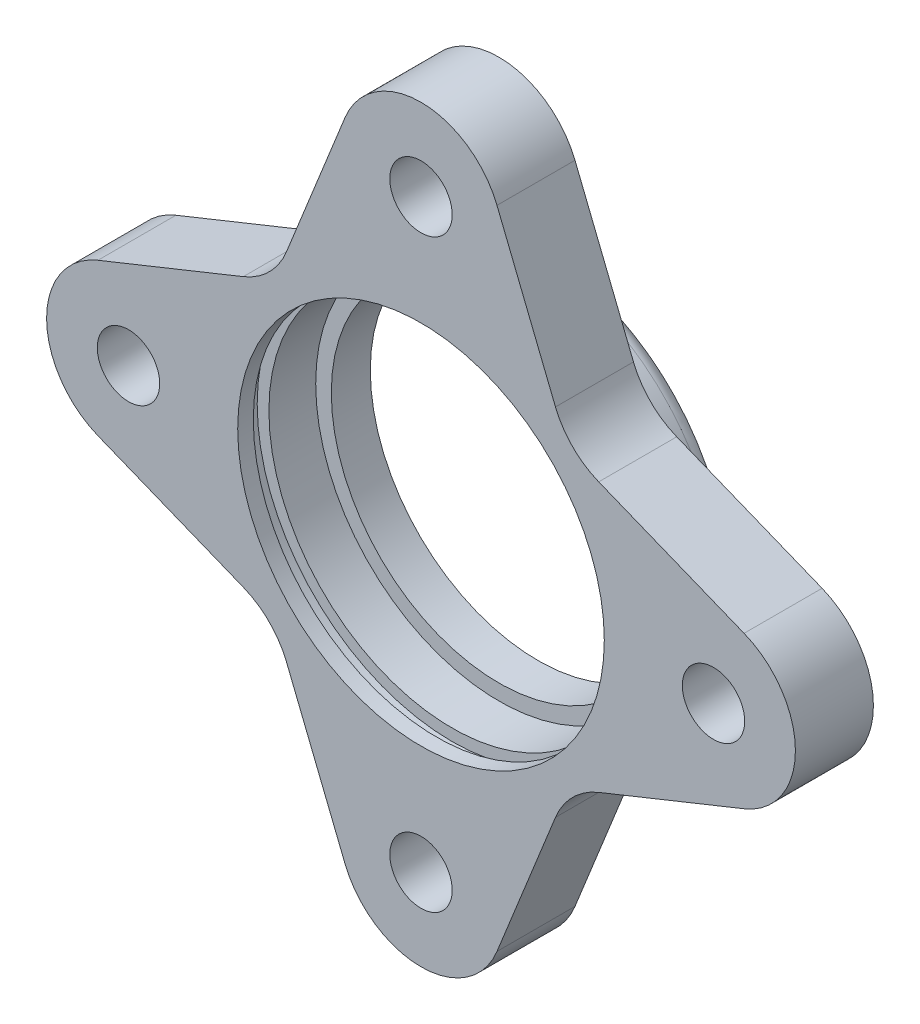
ISO-10303-21;
HEADER;
FILE_DESCRIPTION(('STEP AP214'),'2;1');
FILE_NAME('part.step','',(''),(''),'','','');
FILE_SCHEMA(('AUTOMOTIVE_DESIGN { 1 0 10303 214 1 1 1 1 }'));
ENDSEC;
DATA;
#1=APPLICATION_CONTEXT('core data for automotive mechanical design processes');
#2=APPLICATION_PROTOCOL_DEFINITION('international standard','automotive_design',2000,#1);
#3=PRODUCT_CONTEXT('',#1,'mechanical');
#4=PRODUCT('Part','Part','',(#3));
#5=PRODUCT_RELATED_PRODUCT_CATEGORY('part','',(#4));
#6=PRODUCT_DEFINITION_FORMATION('','',#4);
#7=PRODUCT_DEFINITION_CONTEXT('part definition',#1,'design');
#8=PRODUCT_DEFINITION('design','',#6,#7);
#9=PRODUCT_DEFINITION_SHAPE('','',#8);
#10=(LENGTH_UNIT() NAMED_UNIT(*) SI_UNIT(.MILLI.,.METRE.));
#11=(NAMED_UNIT(*) PLANE_ANGLE_UNIT() SI_UNIT($,.RADIAN.));
#12=(NAMED_UNIT(*) SI_UNIT($,.STERADIAN.) SOLID_ANGLE_UNIT());
#13=UNCERTAINTY_MEASURE_WITH_UNIT(LENGTH_MEASURE(1.E-05),#10,'distance_accuracy_value','');
#14=(GEOMETRIC_REPRESENTATION_CONTEXT(3) GLOBAL_UNCERTAINTY_ASSIGNED_CONTEXT((#13)) GLOBAL_UNIT_ASSIGNED_CONTEXT((#10,
#11,#12)) REPRESENTATION_CONTEXT('',''));
#15=CARTESIAN_POINT('',(0.,0.,0.));
#16=DIRECTION('',(0.,0.,1.));
#17=DIRECTION('',(1.,0.,0.));
#18=AXIS2_PLACEMENT_3D('',#15,#16,#17);
#19=CARTESIAN_POINT('',(0.,0.,10.));
#20=DIRECTION('',(0.,0.,1.));
#21=DIRECTION('',(1.,0.,0.));
#22=AXIS2_PLACEMENT_3D('',#19,#20,#21);
#23=PLANE('',#22);
#24=CARTESIAN_POINT('',(0.,-37.5,10.));
#25=DIRECTION('',(0.,0.,1.));
#26=DIRECTION('',(1.,0.,0.));
#27=AXIS2_PLACEMENT_3D('',#24,#25,#26);
#28=CIRCLE('',#27,4.);
#29=CARTESIAN_POINT('',(4.,-37.5,10.));
#30=VERTEX_POINT('',#29);
#31=EDGE_CURVE('E298',#30,#30,#28,.T.);
#32=ORIENTED_EDGE('',*,*,#31,.F.);
#33=EDGE_LOOP('',(#32));
#34=FACE_BOUND('',#33,.T.);
#35=CARTESIAN_POINT('',(-37.5,0.,10.));
#36=DIRECTION('',(0.,0.,1.));
#37=DIRECTION('',(1.,0.,0.));
#38=AXIS2_PLACEMENT_3D('',#35,#36,#37);
#39=CIRCLE('',#38,4.00000000000001);
#40=CARTESIAN_POINT('',(-33.5,0.,10.));
#41=VERTEX_POINT('',#40);
#42=EDGE_CURVE('E301',#41,#41,#39,.T.);
#43=ORIENTED_EDGE('',*,*,#42,.F.);
#44=EDGE_LOOP('',(#43));
#45=FACE_BOUND('',#44,.T.);
#46=CARTESIAN_POINT('',(0.,37.5,10.));
#47=DIRECTION('',(0.,0.,1.));
#48=DIRECTION('',(1.,0.,0.));
#49=AXIS2_PLACEMENT_3D('',#46,#47,#48);
#50=CIRCLE('',#49,4.);
#51=CARTESIAN_POINT('',(4.,37.5,10.));
#52=VERTEX_POINT('',#51);
#53=EDGE_CURVE('E305',#52,#52,#50,.T.);
#54=ORIENTED_EDGE('',*,*,#53,.F.);
#55=EDGE_LOOP('',(#54));
#56=FACE_BOUND('',#55,.T.);
#57=CARTESIAN_POINT('',(37.5,0.,10.));
#58=DIRECTION('',(0.,0.,1.));
#59=DIRECTION('',(1.,0.,0.));
#60=AXIS2_PLACEMENT_3D('',#57,#58,#59);
#61=CIRCLE('',#60,4.00000000000001);
#62=CARTESIAN_POINT('',(41.5,0.,10.));
#63=VERTEX_POINT('',#62);
#64=EDGE_CURVE('E308',#63,#63,#61,.T.);
#65=ORIENTED_EDGE('',*,*,#64,.F.);
#66=EDGE_LOOP('',(#65));
#67=FACE_BOUND('',#66,.T.);
#68=CARTESIAN_POINT('',(0.,0.,10.));
#69=DIRECTION('',(0.,0.,1.));
#70=DIRECTION('',(1.,0.,0.));
#71=AXIS2_PLACEMENT_3D('',#68,#69,#70);
#72=CIRCLE('',#71,23.5);
#73=CARTESIAN_POINT('',(23.5,0.,10.));
#74=VERTEX_POINT('',#73);
#75=EDGE_CURVE('E311',#74,#74,#72,.T.);
#76=ORIENTED_EDGE('',*,*,#75,.F.);
#77=EDGE_LOOP('',(#76));
#78=FACE_BOUND('',#77,.T.);
#79=CARTESIAN_POINT('',(-37.5,-1.30930550206618E-13,10.));
#80=DIRECTION('',(0.,0.,-1.));
#81=DIRECTION('',(0.,-1.,0.));
#82=AXIS2_PLACEMENT_3D('',#79,#80,#81);
#83=CIRCLE('',#82,10.5);
#84=CARTESIAN_POINT('',(-41.4194101311591,-9.74105868085021,10.));
#85=VERTEX_POINT('',#84);
#86=CARTESIAN_POINT('',(-41.4194101311592,9.74105868085004,10.));
#87=VERTEX_POINT('',#86);
#88=EDGE_CURVE('E155',#85,#87,#83,.T.);
#89=ORIENTED_EDGE('',*,*,#88,.F.);
#90=DIRECTION('',(0.927719874366686,-0.37327715534849,0.));
#91=VECTOR('',#90,1.);
#92=CARTESIAN_POINT('',(-9.14450393259891,-22.7271825182448,10.));
#93=LINE('',#92,#91);
#94=CARTESIAN_POINT('',(-22.7837327410107,-17.2393055508286,10.));
#95=VERTEX_POINT('',#94);
#96=EDGE_CURVE('E159',#85,#95,#93,.T.);
#97=ORIENTED_EDGE('',*,*,#96,.T.);
#98=CARTESIAN_POINT('',(-26.5165042944956,-26.5165042944955,10.));
#99=DIRECTION('',(0.,0.,-1.));
#100=DIRECTION('',(1.,0.,0.));
#101=AXIS2_PLACEMENT_3D('',#98,#99,#100);
#102=CIRCLE('',#101,10.);
#103=CARTESIAN_POINT('',(-17.2393055508287,-22.7837327410106,10.));
#104=VERTEX_POINT('',#103);
#105=EDGE_CURVE('E179',#95,#104,#102,.T.);
#106=ORIENTED_EDGE('',*,*,#105,.T.);
#107=DIRECTION('',(-0.373277155348493,0.927719874366685,0.));
#108=VECTOR('',#107,1.);
#109=CARTESIAN_POINT('',(-22.7271825182448,-9.14450393259902,10.));
#110=LINE('',#109,#108);
#111=CARTESIAN_POINT('',(-9.74105868085018,-41.4194101311592,10.));
#112=VERTEX_POINT('',#111);
#113=EDGE_CURVE('E175',#112,#104,#110,.T.);
#114=ORIENTED_EDGE('',*,*,#113,.F.);
#115=CARTESIAN_POINT('',(3.92791650619853E-13,-37.5,10.));
#116=DIRECTION('',(0.,0.,-1.));
#117=DIRECTION('',(0.,1.,0.));
#118=AXIS2_PLACEMENT_3D('',#115,#116,#117);
#119=CIRCLE('',#118,10.5);
#120=CARTESIAN_POINT('',(9.74105868085064,-41.419410131159,10.));
#121=VERTEX_POINT('',#120);
#122=EDGE_CURVE('E203',#121,#112,#119,.T.);
#123=ORIENTED_EDGE('',*,*,#122,.F.);
#124=DIRECTION('',(0.37327715534848,0.92771987436669,0.));
#125=VECTOR('',#124,1.);
#126=CARTESIAN_POINT('',(22.7271825182449,-9.14450393259867,10.));
#127=LINE('',#126,#125);
#128=CARTESIAN_POINT('',(17.2393055508289,-22.7837327410105,10.));
#129=VERTEX_POINT('',#128);
#130=EDGE_CURVE('E205',#121,#129,#127,.T.);
#131=ORIENTED_EDGE('',*,*,#130,.T.);
#132=CARTESIAN_POINT('',(26.5165042944958,-26.5165042944953,10.));
#133=DIRECTION('',(0.,0.,-1.));
#134=DIRECTION('',(0.,1.,0.));
#135=AXIS2_PLACEMENT_3D('',#132,#133,#134);
#136=CIRCLE('',#135,10.);
#137=CARTESIAN_POINT('',(22.7837327410107,-17.2393055508285,10.));
#138=VERTEX_POINT('',#137);
#139=EDGE_CURVE('E209',#129,#138,#136,.T.);
#140=ORIENTED_EDGE('',*,*,#139,.T.);
#141=DIRECTION('',(-0.927719874366681,-0.373277155348502,0.));
#142=VECTOR('',#141,1.);
#143=CARTESIAN_POINT('',(9.14450393259926,-22.7271825182447,10.));
#144=LINE('',#143,#142);
#145=CARTESIAN_POINT('',(41.4194101311593,-9.74105868084975,10.));
#146=VERTEX_POINT('',#145);
#147=EDGE_CURVE('E212',#146,#138,#144,.T.);
#148=ORIENTED_EDGE('',*,*,#147,.F.);
#149=CARTESIAN_POINT('',(37.5,0.,10.));
#150=DIRECTION('',(0.,0.,-1.));
#151=DIRECTION('',(-1.,0.,0.));
#152=AXIS2_PLACEMENT_3D('',#149,#150,#151);
#153=CIRCLE('',#152,10.5);
#154=CARTESIAN_POINT('',(41.4194101311591,9.74105868085021,10.));
#155=VERTEX_POINT('',#154);
#156=EDGE_CURVE('E255',#155,#146,#153,.T.);
#157=ORIENTED_EDGE('',*,*,#156,.F.);
#158=DIRECTION('',(-0.927719874366686,0.37327715534849,0.));
#159=VECTOR('',#158,1.);
#160=CARTESIAN_POINT('',(9.14450393259891,22.7271825182448,10.));
#161=LINE('',#160,#159);
#162=CARTESIAN_POINT('',(22.7837327410107,17.2393055508286,10.));
#163=VERTEX_POINT('',#162);
#164=EDGE_CURVE('E257',#155,#163,#161,.T.);
#165=ORIENTED_EDGE('',*,*,#164,.T.);
#166=CARTESIAN_POINT('',(26.5165042944956,26.5165042944955,10.));
#167=DIRECTION('',(0.,0.,-1.));
#168=DIRECTION('',(-1.,0.,0.));
#169=AXIS2_PLACEMENT_3D('',#166,#167,#168);
#170=CIRCLE('',#169,10.);
#171=CARTESIAN_POINT('',(17.2393055508287,22.7837327410106,10.));
#172=VERTEX_POINT('',#171);
#173=EDGE_CURVE('E261',#163,#172,#170,.T.);
#174=ORIENTED_EDGE('',*,*,#173,.T.);
#175=DIRECTION('',(0.373277155348493,-0.927719874366685,0.));
#176=VECTOR('',#175,1.);
#177=CARTESIAN_POINT('',(22.7271825182448,9.14450393259902,10.));
#178=LINE('',#177,#176);
#179=CARTESIAN_POINT('',(9.74105868085018,41.4194101311592,10.));
#180=VERTEX_POINT('',#179);
#181=EDGE_CURVE('E264',#180,#172,#178,.T.);
#182=ORIENTED_EDGE('',*,*,#181,.F.);
#183=CARTESIAN_POINT('',(0.,37.5,10.));
#184=DIRECTION('',(0.,0.,-1.));
#185=DIRECTION('',(-1.,0.,0.));
#186=AXIS2_PLACEMENT_3D('',#183,#184,#185);
#187=CIRCLE('',#186,10.5);
#188=CARTESIAN_POINT('',(-9.74105868085035,41.4194101311591,10.));
#189=VERTEX_POINT('',#188);
#190=EDGE_CURVE('E62',#189,#180,#187,.T.);
#191=ORIENTED_EDGE('',*,*,#190,.F.);
#192=DIRECTION('',(-0.373277155348486,-0.927719874366687,0.));
#193=VECTOR('',#192,1.);
#194=CARTESIAN_POINT('',(-22.7271825182448,9.14450393259883,10.));
#195=LINE('',#194,#193);
#196=CARTESIAN_POINT('',(-17.2393055508287,22.7837327410106,10.));
#197=VERTEX_POINT('',#196);
#198=EDGE_CURVE('E232',#189,#197,#195,.T.);
#199=ORIENTED_EDGE('',*,*,#198,.T.);
#200=CARTESIAN_POINT('',(-26.5165042944956,26.5165042944955,10.));
#201=DIRECTION('',(0.,0.,-1.));
#202=DIRECTION('',(0.,-1.,0.));
#203=AXIS2_PLACEMENT_3D('',#200,#201,#202);
#204=CIRCLE('',#203,10.);
#205=CARTESIAN_POINT('',(-22.7837327410106,17.2393055508287,10.));
#206=VERTEX_POINT('',#205);
#207=EDGE_CURVE('E235',#197,#206,#204,.T.);
#208=ORIENTED_EDGE('',*,*,#207,.T.);
#209=DIRECTION('',(0.927719874366684,0.373277155348496,0.));
#210=VECTOR('',#209,1.);
#211=CARTESIAN_POINT('',(-9.1445039325991,22.7271825182448,10.));
#212=LINE('',#211,#210);
#213=EDGE_CURVE('E161',#87,#206,#212,.T.);
#214=ORIENTED_EDGE('',*,*,#213,.F.);
#215=EDGE_LOOP('',(#89,#97,#106,#114,#123,#131,#140,#148,#157,#165,#174,#182,#191,#199,#208,#214));
#216=FACE_BOUND('',#215,.T.);
#217=ADVANCED_FACE('F38',(#34,#45,#56,#67,#78,#216),#23,.T.);
#218=CARTESIAN_POINT('',(0.,0.,0.));
#219=DIRECTION('',(0.,0.,1.));
#220=DIRECTION('',(1.,0.,0.));
#221=AXIS2_PLACEMENT_3D('',#218,#219,#220);
#222=PLANE('',#221);
#223=CARTESIAN_POINT('',(0.,0.,0.));
#224=DIRECTION('',(0.,0.,1.));
#225=DIRECTION('',(1.,0.,0.));
#226=AXIS2_PLACEMENT_3D('',#223,#224,#225);
#227=CIRCLE('',#226,26.5);
#228=CARTESIAN_POINT('',(26.5,0.,0.));
#229=VERTEX_POINT('',#228);
#230=EDGE_CURVE('E11',#229,#229,#227,.T.);
#231=ORIENTED_EDGE('',*,*,#230,.T.);
#232=EDGE_LOOP('',(#231));
#233=FACE_BOUND('',#232,.T.);
#234=CARTESIAN_POINT('',(0.,-37.5,0.));
#235=DIRECTION('',(0.,0.,1.));
#236=DIRECTION('',(1.,0.,0.));
#237=AXIS2_PLACEMENT_3D('',#234,#235,#236);
#238=CIRCLE('',#237,4.);
#239=CARTESIAN_POINT('',(4.,-37.5,0.));
#240=VERTEX_POINT('',#239);
#241=EDGE_CURVE('E295',#240,#240,#238,.T.);
#242=ORIENTED_EDGE('',*,*,#241,.T.);
#243=EDGE_LOOP('',(#242));
#244=FACE_BOUND('',#243,.T.);
#245=CARTESIAN_POINT('',(-37.5,0.,0.));
#246=DIRECTION('',(0.,0.,1.));
#247=DIRECTION('',(1.,0.,0.));
#248=AXIS2_PLACEMENT_3D('',#245,#246,#247);
#249=CIRCLE('',#248,4.00000000000001);
#250=CARTESIAN_POINT('',(-33.5,0.,0.));
#251=VERTEX_POINT('',#250);
#252=EDGE_CURVE('E317',#251,#251,#249,.T.);
#253=ORIENTED_EDGE('',*,*,#252,.T.);
#254=EDGE_LOOP('',(#253));
#255=FACE_BOUND('',#254,.T.);
#256=CARTESIAN_POINT('',(0.,37.5,0.));
#257=DIRECTION('',(0.,0.,1.));
#258=DIRECTION('',(1.,0.,0.));
#259=AXIS2_PLACEMENT_3D('',#256,#257,#258);
#260=CIRCLE('',#259,4.);
#261=CARTESIAN_POINT('',(4.,37.5,0.));
#262=VERTEX_POINT('',#261);
#263=EDGE_CURVE('E320',#262,#262,#260,.T.);
#264=ORIENTED_EDGE('',*,*,#263,.T.);
#265=EDGE_LOOP('',(#264));
#266=FACE_BOUND('',#265,.T.);
#267=CARTESIAN_POINT('',(37.5,0.,0.));
#268=DIRECTION('',(0.,0.,1.));
#269=DIRECTION('',(1.,0.,0.));
#270=AXIS2_PLACEMENT_3D('',#267,#268,#269);
#271=CIRCLE('',#270,4.00000000000001);
#272=CARTESIAN_POINT('',(41.5,0.,0.));
#273=VERTEX_POINT('',#272);
#274=EDGE_CURVE('E323',#273,#273,#271,.T.);
#275=ORIENTED_EDGE('',*,*,#274,.T.);
#276=EDGE_LOOP('',(#275));
#277=FACE_BOUND('',#276,.T.);
#278=DIRECTION('',(0.927719874366686,-0.37327715534849,0.));
#279=VECTOR('',#278,1.);
#280=CARTESIAN_POINT('',(-9.14450393259891,-22.7271825182448,0.));
#281=LINE('',#280,#279);
#282=CARTESIAN_POINT('',(-41.4194101311591,-9.74105868085021,0.));
#283=VERTEX_POINT('',#282);
#284=CARTESIAN_POINT('',(-22.7837327410107,-17.2393055508286,0.));
#285=VERTEX_POINT('',#284);
#286=EDGE_CURVE('E191',#283,#285,#281,.T.);
#287=ORIENTED_EDGE('',*,*,#286,.F.);
#288=CARTESIAN_POINT('',(-37.5,-1.30930550206618E-13,0.));
#289=DIRECTION('',(0.,0.,-1.));
#290=DIRECTION('',(0.,-1.,0.));
#291=AXIS2_PLACEMENT_3D('',#288,#289,#290);
#292=CIRCLE('',#291,10.5);
#293=CARTESIAN_POINT('',(-41.4194101311592,9.74105868085004,0.));
#294=VERTEX_POINT('',#293);
#295=EDGE_CURVE('E170',#283,#294,#292,.T.);
#296=ORIENTED_EDGE('',*,*,#295,.T.);
#297=DIRECTION('',(0.927719874366684,0.373277155348496,0.));
#298=VECTOR('',#297,1.);
#299=CARTESIAN_POINT('',(-9.1445039325991,22.7271825182448,0.));
#300=LINE('',#299,#298);
#301=CARTESIAN_POINT('',(-22.7837327410106,17.2393055508287,0.));
#302=VERTEX_POINT('',#301);
#303=EDGE_CURVE('E243',#294,#302,#300,.T.);
#304=ORIENTED_EDGE('',*,*,#303,.T.);
#305=CARTESIAN_POINT('',(-26.5165042944956,26.5165042944955,0.));
#306=DIRECTION('',(0.,0.,-1.));
#307=DIRECTION('',(0.,-1.,0.));
#308=AXIS2_PLACEMENT_3D('',#305,#306,#307);
#309=CIRCLE('',#308,10.);
#310=CARTESIAN_POINT('',(-17.2393055508287,22.7837327410106,0.));
#311=VERTEX_POINT('',#310);
#312=EDGE_CURVE('E240',#311,#302,#309,.T.);
#313=ORIENTED_EDGE('',*,*,#312,.F.);
#314=DIRECTION('',(-0.373277155348486,-0.927719874366687,0.));
#315=VECTOR('',#314,1.);
#316=CARTESIAN_POINT('',(-22.7271825182448,9.14450393259883,0.));
#317=LINE('',#316,#315);
#318=CARTESIAN_POINT('',(-9.74105868085035,41.4194101311591,0.));
#319=VERTEX_POINT('',#318);
#320=EDGE_CURVE('E226',#319,#311,#317,.T.);
#321=ORIENTED_EDGE('',*,*,#320,.F.);
#322=CARTESIAN_POINT('',(0.,37.5,0.));
#323=DIRECTION('',(0.,0.,-1.));
#324=DIRECTION('',(-1.,0.,0.));
#325=AXIS2_PLACEMENT_3D('',#322,#323,#324);
#326=CIRCLE('',#325,10.5);
#327=CARTESIAN_POINT('',(9.74105868085018,41.4194101311592,0.));
#328=VERTEX_POINT('',#327);
#329=EDGE_CURVE('E258',#319,#328,#326,.T.);
#330=ORIENTED_EDGE('',*,*,#329,.T.);
#331=DIRECTION('',(0.373277155348493,-0.927719874366685,0.));
#332=VECTOR('',#331,1.);
#333=CARTESIAN_POINT('',(22.7271825182448,9.14450393259902,0.));
#334=LINE('',#333,#332);
#335=CARTESIAN_POINT('',(17.2393055508287,22.7837327410106,0.));
#336=VERTEX_POINT('',#335);
#337=EDGE_CURVE('E274',#328,#336,#334,.T.);
#338=ORIENTED_EDGE('',*,*,#337,.T.);
#339=CARTESIAN_POINT('',(26.5165042944956,26.5165042944955,0.));
#340=DIRECTION('',(0.,0.,-1.));
#341=DIRECTION('',(-1.,0.,0.));
#342=AXIS2_PLACEMENT_3D('',#339,#340,#341);
#343=CIRCLE('',#342,10.);
#344=CARTESIAN_POINT('',(22.7837327410107,17.2393055508286,0.));
#345=VERTEX_POINT('',#344);
#346=EDGE_CURVE('E271',#345,#336,#343,.T.);
#347=ORIENTED_EDGE('',*,*,#346,.F.);
#348=DIRECTION('',(-0.927719874366686,0.37327715534849,0.));
#349=VECTOR('',#348,1.);
#350=CARTESIAN_POINT('',(9.14450393259891,22.7271825182448,0.));
#351=LINE('',#350,#349);
#352=CARTESIAN_POINT('',(41.4194101311591,9.7410586808502,0.));
#353=VERTEX_POINT('',#352);
#354=EDGE_CURVE('E268',#353,#345,#351,.T.);
#355=ORIENTED_EDGE('',*,*,#354,.F.);
#356=CARTESIAN_POINT('',(37.5,0.,0.));
#357=DIRECTION('',(0.,0.,-1.));
#358=DIRECTION('',(-1.,0.,0.));
#359=AXIS2_PLACEMENT_3D('',#356,#357,#358);
#360=CIRCLE('',#359,10.5);
#361=CARTESIAN_POINT('',(41.4194101311593,-9.74105868084975,0.));
#362=VERTEX_POINT('',#361);
#363=EDGE_CURVE('E53',#353,#362,#360,.T.);
#364=ORIENTED_EDGE('',*,*,#363,.T.);
#365=DIRECTION('',(-0.927719874366681,-0.373277155348502,0.));
#366=VECTOR('',#365,1.);
#367=CARTESIAN_POINT('',(9.14450393259926,-22.7271825182447,0.));
#368=LINE('',#367,#366);
#369=CARTESIAN_POINT('',(22.7837327410107,-17.2393055508285,0.));
#370=VERTEX_POINT('',#369);
#371=EDGE_CURVE('E206',#362,#370,#368,.T.);
#372=ORIENTED_EDGE('',*,*,#371,.T.);
#373=CARTESIAN_POINT('',(26.5165042944958,-26.5165042944953,0.));
#374=DIRECTION('',(0.,0.,-1.));
#375=DIRECTION('',(0.,1.,0.));
#376=AXIS2_PLACEMENT_3D('',#373,#374,#375);
#377=CIRCLE('',#376,10.);
#378=CARTESIAN_POINT('',(17.2393055508289,-22.7837327410105,0.));
#379=VERTEX_POINT('',#378);
#380=EDGE_CURVE('E219',#379,#370,#377,.T.);
#381=ORIENTED_EDGE('',*,*,#380,.F.);
#382=DIRECTION('',(0.37327715534848,0.92771987436669,0.));
#383=VECTOR('',#382,1.);
#384=CARTESIAN_POINT('',(22.7271825182449,-9.14450393259867,0.));
#385=LINE('',#384,#383);
#386=CARTESIAN_POINT('',(9.74105868085064,-41.419410131159,0.));
#387=VERTEX_POINT('',#386);
#388=EDGE_CURVE('E216',#387,#379,#385,.T.);
#389=ORIENTED_EDGE('',*,*,#388,.F.);
#390=CARTESIAN_POINT('',(3.92791650619853E-13,-37.5,0.));
#391=DIRECTION('',(0.,0.,-1.));
#392=DIRECTION('',(0.,1.,0.));
#393=AXIS2_PLACEMENT_3D('',#390,#391,#392);
#394=CIRCLE('',#393,10.5);
#395=CARTESIAN_POINT('',(-9.74105868085018,-41.4194101311592,0.));
#396=VERTEX_POINT('',#395);
#397=EDGE_CURVE('E199',#387,#396,#394,.T.);
#398=ORIENTED_EDGE('',*,*,#397,.T.);
#399=DIRECTION('',(-0.373277155348493,0.927719874366685,0.));
#400=VECTOR('',#399,1.);
#401=CARTESIAN_POINT('',(-22.7271825182448,-9.14450393259902,0.));
#402=LINE('',#401,#400);
#403=CARTESIAN_POINT('',(-17.2393055508287,-22.7837327410106,0.));
#404=VERTEX_POINT('',#403);
#405=EDGE_CURVE('E180',#396,#404,#402,.T.);
#406=ORIENTED_EDGE('',*,*,#405,.T.);
#407=CARTESIAN_POINT('',(-26.5165042944956,-26.5165042944955,0.));
#408=DIRECTION('',(0.,0.,-1.));
#409=DIRECTION('',(1.,0.,0.));
#410=AXIS2_PLACEMENT_3D('',#407,#408,#409);
#411=CIRCLE('',#410,10.);
#412=EDGE_CURVE('E184',#285,#404,#411,.T.);
#413=ORIENTED_EDGE('',*,*,#412,.F.);
#414=EDGE_LOOP('',(#287,#296,#304,#313,#321,#330,#338,#347,#355,#364,#372,#381,#389,#398,#406,#413));
#415=FACE_BOUND('',#414,.T.);
#416=ADVANCED_FACE('F348',(#233,#244,#255,#266,#277,#415),#222,.F.);
#417=CARTESIAN_POINT('',(0.,0.,10.));
#418=DIRECTION('',(0.,0.,-1.));
#419=DIRECTION('',(-1.,0.,0.));
#420=AXIS2_PLACEMENT_3D('',#417,#418,#419);
#421=CYLINDRICAL_SURFACE('',#420,23.5);
#422=CARTESIAN_POINT('',(0.,0.,0.));
#423=DIRECTION('',(0.,0.,1.));
#424=DIRECTION('',(1.,0.,0.));
#425=AXIS2_PLACEMENT_3D('',#422,#423,#424);
#426=CIRCLE('',#425,23.5);
#427=CARTESIAN_POINT('',(23.5,0.,0.));
#428=VERTEX_POINT('',#427);
#429=EDGE_CURVE('E302',#428,#428,#426,.T.);
#430=ORIENTED_EDGE('',*,*,#429,.F.);
#431=EDGE_LOOP('',(#430));
#432=FACE_BOUND('',#431,.T.);
#433=CARTESIAN_POINT('',(0.,0.,6.));
#434=DIRECTION('',(0.,0.,1.));
#435=DIRECTION('',(1.,0.,0.));
#436=AXIS2_PLACEMENT_3D('',#433,#434,#435);
#437=CIRCLE('',#436,23.5);
#438=CARTESIAN_POINT('',(23.5,0.,6.));
#439=VERTEX_POINT('',#438);
#440=EDGE_CURVE('E286',#439,#439,#437,.T.);
#441=ORIENTED_EDGE('',*,*,#440,.T.);
#442=EDGE_LOOP('',(#441));
#443=FACE_BOUND('',#442,.T.);
#444=ADVANCED_FACE('F354',(#432,#443),#421,.F.);
#445=CARTESIAN_POINT('',(37.5,0.,10.));
#446=DIRECTION('',(0.,0.,-1.));
#447=DIRECTION('',(-1.,0.,0.));
#448=AXIS2_PLACEMENT_3D('',#445,#446,#447);
#449=CYLINDRICAL_SURFACE('',#448,4.00000000000001);
#450=ORIENTED_EDGE('',*,*,#64,.T.);
#451=EDGE_LOOP('',(#450));
#452=FACE_BOUND('',#451,.T.);
#453=ORIENTED_EDGE('',*,*,#274,.F.);
#454=EDGE_LOOP('',(#453));
#455=FACE_BOUND('',#454,.T.);
#456=ADVANCED_FACE('F368',(#452,#455),#449,.F.);
#457=CARTESIAN_POINT('',(0.,37.5,10.));
#458=DIRECTION('',(0.,0.,-1.));
#459=DIRECTION('',(-1.,0.,0.));
#460=AXIS2_PLACEMENT_3D('',#457,#458,#459);
#461=CYLINDRICAL_SURFACE('',#460,4.);
#462=ORIENTED_EDGE('',*,*,#53,.T.);
#463=EDGE_LOOP('',(#462));
#464=FACE_BOUND('',#463,.T.);
#465=ORIENTED_EDGE('',*,*,#263,.F.);
#466=EDGE_LOOP('',(#465));
#467=FACE_BOUND('',#466,.T.);
#468=ADVANCED_FACE('F371',(#464,#467),#461,.F.);
#469=CARTESIAN_POINT('',(-37.5,0.,10.));
#470=DIRECTION('',(0.,0.,-1.));
#471=DIRECTION('',(-1.,0.,0.));
#472=AXIS2_PLACEMENT_3D('',#469,#470,#471);
#473=CYLINDRICAL_SURFACE('',#472,4.00000000000001);
#474=ORIENTED_EDGE('',*,*,#42,.T.);
#475=EDGE_LOOP('',(#474));
#476=FACE_BOUND('',#475,.T.);
#477=ORIENTED_EDGE('',*,*,#252,.F.);
#478=EDGE_LOOP('',(#477));
#479=FACE_BOUND('',#478,.T.);
#480=ADVANCED_FACE('F375',(#476,#479),#473,.F.);
#481=CARTESIAN_POINT('',(0.,-37.5,10.));
#482=DIRECTION('',(0.,0.,-1.));
#483=DIRECTION('',(-1.,0.,0.));
#484=AXIS2_PLACEMENT_3D('',#481,#482,#483);
#485=CYLINDRICAL_SURFACE('',#484,4.);
#486=ORIENTED_EDGE('',*,*,#31,.T.);
#487=EDGE_LOOP('',(#486));
#488=FACE_BOUND('',#487,.T.);
#489=ORIENTED_EDGE('',*,*,#241,.F.);
#490=EDGE_LOOP('',(#489));
#491=FACE_BOUND('',#490,.T.);
#492=ADVANCED_FACE('F366',(#488,#491),#485,.F.);
#493=CARTESIAN_POINT('',(0.,0.,8.));
#494=DIRECTION('',(0.,0.,1.));
#495=DIRECTION('',(1.,0.,0.));
#496=AXIS2_PLACEMENT_3D('',#493,#494,#495);
#497=CIRCLE('',#496,23.5);
#498=CARTESIAN_POINT('',(23.5,0.,8.));
#499=VERTEX_POINT('',#498);
#500=EDGE_CURVE('E280',#499,#499,#497,.T.);
#501=ORIENTED_EDGE('',*,*,#500,.F.);
#502=EDGE_LOOP('',(#501));
#503=FACE_BOUND('',#502,.T.);
#504=ORIENTED_EDGE('',*,*,#75,.T.);
#505=EDGE_LOOP('',(#504));
#506=FACE_BOUND('',#505,.T.);
#507=ADVANCED_FACE('F363',(#503,#506),#421,.F.);
#508=CARTESIAN_POINT('',(0.,0.,6.));
#509=DIRECTION('',(0.,0.,1.));
#510=DIRECTION('',(1.,0.,0.));
#511=AXIS2_PLACEMENT_3D('',#508,#509,#510);
#512=CYLINDRICAL_SURFACE('',#511,25.);
#513=CARTESIAN_POINT('',(0.,0.,6.));
#514=DIRECTION('',(0.,0.,1.));
#515=DIRECTION('',(1.,0.,0.));
#516=AXIS2_PLACEMENT_3D('',#513,#514,#515);
#517=CIRCLE('',#516,25.);
#518=CARTESIAN_POINT('',(25.,0.,6.));
#519=VERTEX_POINT('',#518);
#520=EDGE_CURVE('E292',#519,#519,#517,.T.);
#521=ORIENTED_EDGE('',*,*,#520,.F.);
#522=EDGE_LOOP('',(#521));
#523=FACE_BOUND('',#522,.T.);
#524=CARTESIAN_POINT('',(0.,0.,8.));
#525=DIRECTION('',(0.,0.,1.));
#526=DIRECTION('',(1.,0.,0.));
#527=AXIS2_PLACEMENT_3D('',#524,#525,#526);
#528=CIRCLE('',#527,25.);
#529=CARTESIAN_POINT('',(25.,0.,8.));
#530=VERTEX_POINT('',#529);
#531=EDGE_CURVE('E289',#530,#530,#528,.T.);
#532=ORIENTED_EDGE('',*,*,#531,.T.);
#533=EDGE_LOOP('',(#532));
#534=FACE_BOUND('',#533,.T.);
#535=ADVANCED_FACE('F360',(#523,#534),#512,.F.);
#536=CARTESIAN_POINT('',(0.,0.,6.));
#537=DIRECTION('',(0.,0.,1.));
#538=DIRECTION('',(1.,0.,0.));
#539=AXIS2_PLACEMENT_3D('',#536,#537,#538);
#540=PLANE('',#539);
#541=ORIENTED_EDGE('',*,*,#440,.F.);
#542=EDGE_LOOP('',(#541));
#543=FACE_BOUND('',#542,.T.);
#544=ORIENTED_EDGE('',*,*,#520,.T.);
#545=EDGE_LOOP('',(#544));
#546=FACE_BOUND('',#545,.T.);
#547=ADVANCED_FACE('F470',(#543,#546),#540,.T.);
#548=CARTESIAN_POINT('',(0.,0.,8.));
#549=DIRECTION('',(0.,0.,1.));
#550=DIRECTION('',(1.,0.,0.));
#551=AXIS2_PLACEMENT_3D('',#548,#549,#550);
#552=PLANE('',#551);
#553=ORIENTED_EDGE('',*,*,#500,.T.);
#554=EDGE_LOOP('',(#553));
#555=FACE_BOUND('',#554,.T.);
#556=ORIENTED_EDGE('',*,*,#531,.F.);
#557=EDGE_LOOP('',(#556));
#558=FACE_BOUND('',#557,.T.);
#559=ADVANCED_FACE('F469',(#555,#558),#552,.F.);
#560=CARTESIAN_POINT('',(37.5,0.,10.));
#561=DIRECTION('',(0.,0.,-1.));
#562=DIRECTION('',(-1.,0.,0.));
#563=AXIS2_PLACEMENT_3D('',#560,#561,#562);
#564=CYLINDRICAL_SURFACE('',#563,10.5);
#565=ORIENTED_EDGE('',*,*,#363,.F.);
#566=DIRECTION('',(0.,0.,-1.));
#567=VECTOR('',#566,1.);
#568=CARTESIAN_POINT('',(41.4194101311591,9.74105868085021,10.));
#569=LINE('',#568,#567);
#570=EDGE_CURVE('E82',#155,#353,#569,.T.);
#571=ORIENTED_EDGE('',*,*,#570,.F.);
#572=ORIENTED_EDGE('',*,*,#156,.T.);
#573=DIRECTION('',(0.,0.,-1.));
#574=VECTOR('',#573,1.);
#575=CARTESIAN_POINT('',(41.4194101311593,-9.74105868084975,10.));
#576=LINE('',#575,#574);
#577=EDGE_CURVE('E224',#146,#362,#576,.T.);
#578=ORIENTED_EDGE('',*,*,#577,.T.);
#579=EDGE_LOOP('',(#565,#571,#572,#578));
#580=FACE_BOUND('',#579,.T.);
#581=ADVANCED_FACE('F422',(#580),#564,.T.);
#582=CARTESIAN_POINT('',(0.,37.5,10.));
#583=DIRECTION('',(0.,0.,-1.));
#584=DIRECTION('',(-1.,0.,0.));
#585=AXIS2_PLACEMENT_3D('',#582,#583,#584);
#586=CYLINDRICAL_SURFACE('',#585,10.5);
#587=ORIENTED_EDGE('',*,*,#329,.F.);
#588=DIRECTION('',(0.,0.,-1.));
#589=VECTOR('',#588,1.);
#590=CARTESIAN_POINT('',(-9.74105868085035,41.4194101311591,10.));
#591=LINE('',#590,#589);
#592=EDGE_CURVE('E164',#189,#319,#591,.T.);
#593=ORIENTED_EDGE('',*,*,#592,.F.);
#594=ORIENTED_EDGE('',*,*,#190,.T.);
#595=DIRECTION('',(0.,0.,-1.));
#596=VECTOR('',#595,1.);
#597=CARTESIAN_POINT('',(9.74105868085018,41.4194101311592,10.));
#598=LINE('',#597,#596);
#599=EDGE_CURVE('E78',#180,#328,#598,.T.);
#600=ORIENTED_EDGE('',*,*,#599,.T.);
#601=EDGE_LOOP('',(#587,#593,#594,#600));
#602=FACE_BOUND('',#601,.T.);
#603=ADVANCED_FACE('F435',(#602),#586,.T.);
#604=CARTESIAN_POINT('',(22.7271825182448,9.14450393259902,10.));
#605=DIRECTION('',(0.927719874366685,0.373277155348493,0.));
#606=DIRECTION('',(-0.373277155348493,0.927719874366685,0.));
#607=AXIS2_PLACEMENT_3D('',#604,#605,#606);
#608=PLANE('',#607);
#609=ORIENTED_EDGE('',*,*,#337,.F.);
#610=ORIENTED_EDGE('',*,*,#599,.F.);
#611=ORIENTED_EDGE('',*,*,#181,.T.);
#612=DIRECTION('',(0.,0.,-1.));
#613=VECTOR('',#612,1.);
#614=CARTESIAN_POINT('',(17.2393055508287,22.7837327410106,10.));
#615=LINE('',#614,#613);
#616=EDGE_CURVE('E281',#172,#336,#615,.T.);
#617=ORIENTED_EDGE('',*,*,#616,.T.);
#618=EDGE_LOOP('',(#609,#610,#611,#617));
#619=FACE_BOUND('',#618,.T.);
#620=ADVANCED_FACE('F433',(#619),#608,.T.);
#621=CARTESIAN_POINT('',(26.5165042944956,26.5165042944955,10.));
#622=DIRECTION('',(0.,0.,-1.));
#623=DIRECTION('',(-1.,0.,0.));
#624=AXIS2_PLACEMENT_3D('',#621,#622,#623);
#625=CYLINDRICAL_SURFACE('',#624,10.);
#626=ORIENTED_EDGE('',*,*,#346,.T.);
#627=ORIENTED_EDGE('',*,*,#616,.F.);
#628=ORIENTED_EDGE('',*,*,#173,.F.);
#629=DIRECTION('',(0.,0.,-1.));
#630=VECTOR('',#629,1.);
#631=CARTESIAN_POINT('',(22.7837327410107,17.2393055508286,10.));
#632=LINE('',#631,#630);
#633=EDGE_CURVE('E283',#163,#345,#632,.T.);
#634=ORIENTED_EDGE('',*,*,#633,.T.);
#635=EDGE_LOOP('',(#626,#627,#628,#634));
#636=FACE_BOUND('',#635,.T.);
#637=ADVANCED_FACE('F431',(#636),#625,.F.);
#638=CARTESIAN_POINT('',(9.14450393259891,22.7271825182448,10.));
#639=DIRECTION('',(-0.37327715534849,-0.927719874366686,0.));
#640=DIRECTION('',(0.927719874366686,-0.37327715534849,0.));
#641=AXIS2_PLACEMENT_3D('',#638,#639,#640);
#642=PLANE('',#641);
#643=ORIENTED_EDGE('',*,*,#354,.T.);
#644=ORIENTED_EDGE('',*,*,#633,.F.);
#645=ORIENTED_EDGE('',*,*,#164,.F.);
#646=ORIENTED_EDGE('',*,*,#570,.T.);
#647=EDGE_LOOP('',(#643,#644,#645,#646));
#648=FACE_BOUND('',#647,.T.);
#649=ADVANCED_FACE('F426',(#648),#642,.F.);
#650=CARTESIAN_POINT('',(-37.5,-1.30930550206618E-13,10.));
#651=DIRECTION('',(0.,0.,-1.));
#652=DIRECTION('',(-1.,0.,0.));
#653=AXIS2_PLACEMENT_3D('',#650,#651,#652);
#654=CYLINDRICAL_SURFACE('',#653,10.5);
#655=ORIENTED_EDGE('',*,*,#295,.F.);
#656=DIRECTION('',(0.,0.,-1.));
#657=VECTOR('',#656,1.);
#658=CARTESIAN_POINT('',(-41.4194101311591,-9.74105868085021,10.));
#659=LINE('',#658,#657);
#660=EDGE_CURVE('E167',#85,#283,#659,.T.);
#661=ORIENTED_EDGE('',*,*,#660,.F.);
#662=ORIENTED_EDGE('',*,*,#88,.T.);
#663=DIRECTION('',(0.,0.,-1.));
#664=VECTOR('',#663,1.);
#665=CARTESIAN_POINT('',(-41.4194101311592,9.74105868085004,10.));
#666=LINE('',#665,#664);
#667=EDGE_CURVE('E247',#87,#294,#666,.T.);
#668=ORIENTED_EDGE('',*,*,#667,.T.);
#669=EDGE_LOOP('',(#655,#661,#662,#668));
#670=FACE_BOUND('',#669,.T.);
#671=ADVANCED_FACE('F168',(#670),#654,.T.);
#672=CARTESIAN_POINT('',(-9.1445039325991,22.7271825182448,10.));
#673=DIRECTION('',(-0.373277155348496,0.927719874366683,0.));
#674=DIRECTION('',(-0.927719874366683,-0.373277155348496,0.));
#675=AXIS2_PLACEMENT_3D('',#672,#673,#674);
#676=PLANE('',#675);
#677=ORIENTED_EDGE('',*,*,#303,.F.);
#678=ORIENTED_EDGE('',*,*,#667,.F.);
#679=ORIENTED_EDGE('',*,*,#213,.T.);
#680=DIRECTION('',(0.,0.,-1.));
#681=VECTOR('',#680,1.);
#682=CARTESIAN_POINT('',(-22.7837327410106,17.2393055508287,10.));
#683=LINE('',#682,#681);
#684=EDGE_CURVE('E249',#206,#302,#683,.T.);
#685=ORIENTED_EDGE('',*,*,#684,.T.);
#686=EDGE_LOOP('',(#677,#678,#679,#685));
#687=FACE_BOUND('',#686,.T.);
#688=ADVANCED_FACE('F446',(#687),#676,.T.);
#689=CARTESIAN_POINT('',(-26.5165042944956,26.5165042944955,10.));
#690=DIRECTION('',(0.,0.,-1.));
#691=DIRECTION('',(-1.,0.,0.));
#692=AXIS2_PLACEMENT_3D('',#689,#690,#691);
#693=CYLINDRICAL_SURFACE('',#692,10.);
#694=ORIENTED_EDGE('',*,*,#312,.T.);
#695=ORIENTED_EDGE('',*,*,#684,.F.);
#696=ORIENTED_EDGE('',*,*,#207,.F.);
#697=DIRECTION('',(0.,0.,-1.));
#698=VECTOR('',#697,1.);
#699=CARTESIAN_POINT('',(-17.2393055508287,22.7837327410106,10.));
#700=LINE('',#699,#698);
#701=EDGE_CURVE('E251',#197,#311,#700,.T.);
#702=ORIENTED_EDGE('',*,*,#701,.T.);
#703=EDGE_LOOP('',(#694,#695,#696,#702));
#704=FACE_BOUND('',#703,.T.);
#705=ADVANCED_FACE('F443',(#704),#693,.F.);
#706=CARTESIAN_POINT('',(-22.7271825182448,9.14450393259883,10.));
#707=DIRECTION('',(0.927719874366687,-0.373277155348486,0.));
#708=DIRECTION('',(0.373277155348486,0.927719874366687,0.));
#709=AXIS2_PLACEMENT_3D('',#706,#707,#708);
#710=PLANE('',#709);
#711=ORIENTED_EDGE('',*,*,#320,.T.);
#712=ORIENTED_EDGE('',*,*,#701,.F.);
#713=ORIENTED_EDGE('',*,*,#198,.F.);
#714=ORIENTED_EDGE('',*,*,#592,.T.);
#715=EDGE_LOOP('',(#711,#712,#713,#714));
#716=FACE_BOUND('',#715,.T.);
#717=ADVANCED_FACE('F438',(#716),#710,.F.);
#718=CARTESIAN_POINT('',(3.92791650619853E-13,-37.5,10.));
#719=DIRECTION('',(0.,0.,-1.));
#720=DIRECTION('',(-1.,0.,0.));
#721=AXIS2_PLACEMENT_3D('',#718,#719,#720);
#722=CYLINDRICAL_SURFACE('',#721,10.5);
#723=ORIENTED_EDGE('',*,*,#397,.F.);
#724=DIRECTION('',(0.,0.,-1.));
#725=VECTOR('',#724,1.);
#726=CARTESIAN_POINT('',(9.74105868085064,-41.419410131159,10.));
#727=LINE('',#726,#725);
#728=EDGE_CURVE('E214',#121,#387,#727,.T.);
#729=ORIENTED_EDGE('',*,*,#728,.F.);
#730=ORIENTED_EDGE('',*,*,#122,.T.);
#731=DIRECTION('',(0.,0.,-1.));
#732=VECTOR('',#731,1.);
#733=CARTESIAN_POINT('',(-9.74105868085018,-41.4194101311592,10.));
#734=LINE('',#733,#732);
#735=EDGE_CURVE('E196',#112,#396,#734,.T.);
#736=ORIENTED_EDGE('',*,*,#735,.T.);
#737=EDGE_LOOP('',(#723,#729,#730,#736));
#738=FACE_BOUND('',#737,.T.);
#739=ADVANCED_FACE('F406',(#738),#722,.T.);
#740=CARTESIAN_POINT('',(9.14450393259926,-22.7271825182447,10.));
#741=DIRECTION('',(0.373277155348502,-0.927719874366681,0.));
#742=DIRECTION('',(0.927719874366681,0.373277155348502,0.));
#743=AXIS2_PLACEMENT_3D('',#740,#741,#742);
#744=PLANE('',#743);
#745=ORIENTED_EDGE('',*,*,#371,.F.);
#746=ORIENTED_EDGE('',*,*,#577,.F.);
#747=ORIENTED_EDGE('',*,*,#147,.T.);
#748=DIRECTION('',(0.,0.,-1.));
#749=VECTOR('',#748,1.);
#750=CARTESIAN_POINT('',(22.7837327410107,-17.2393055508285,10.));
#751=LINE('',#750,#749);
#752=EDGE_CURVE('E227',#138,#370,#751,.T.);
#753=ORIENTED_EDGE('',*,*,#752,.T.);
#754=EDGE_LOOP('',(#745,#746,#747,#753));
#755=FACE_BOUND('',#754,.T.);
#756=ADVANCED_FACE('F420',(#755),#744,.T.);
#757=CARTESIAN_POINT('',(26.5165042944958,-26.5165042944953,10.));
#758=DIRECTION('',(0.,0.,-1.));
#759=DIRECTION('',(-1.,0.,0.));
#760=AXIS2_PLACEMENT_3D('',#757,#758,#759);
#761=CYLINDRICAL_SURFACE('',#760,10.);
#762=ORIENTED_EDGE('',*,*,#380,.T.);
#763=ORIENTED_EDGE('',*,*,#752,.F.);
#764=ORIENTED_EDGE('',*,*,#139,.F.);
#765=DIRECTION('',(0.,0.,-1.));
#766=VECTOR('',#765,1.);
#767=CARTESIAN_POINT('',(17.2393055508289,-22.7837327410105,10.));
#768=LINE('',#767,#766);
#769=EDGE_CURVE('E229',#129,#379,#768,.T.);
#770=ORIENTED_EDGE('',*,*,#769,.T.);
#771=EDGE_LOOP('',(#762,#763,#764,#770));
#772=FACE_BOUND('',#771,.T.);
#773=ADVANCED_FACE('F416',(#772),#761,.F.);
#774=CARTESIAN_POINT('',(22.7271825182449,-9.14450393259867,10.));
#775=DIRECTION('',(-0.92771987436669,0.37327715534848,0.));
#776=DIRECTION('',(-0.37327715534848,-0.92771987436669,0.));
#777=AXIS2_PLACEMENT_3D('',#774,#775,#776);
#778=PLANE('',#777);
#779=ORIENTED_EDGE('',*,*,#388,.T.);
#780=ORIENTED_EDGE('',*,*,#769,.F.);
#781=ORIENTED_EDGE('',*,*,#130,.F.);
#782=ORIENTED_EDGE('',*,*,#728,.T.);
#783=EDGE_LOOP('',(#779,#780,#781,#782));
#784=FACE_BOUND('',#783,.T.);
#785=ADVANCED_FACE('F410',(#784),#778,.F.);
#786=CARTESIAN_POINT('',(-22.7271825182448,-9.14450393259902,10.));
#787=DIRECTION('',(-0.927719874366685,-0.373277155348493,0.));
#788=DIRECTION('',(0.373277155348493,-0.927719874366685,0.));
#789=AXIS2_PLACEMENT_3D('',#786,#787,#788);
#790=PLANE('',#789);
#791=ORIENTED_EDGE('',*,*,#405,.F.);
#792=ORIENTED_EDGE('',*,*,#735,.F.);
#793=ORIENTED_EDGE('',*,*,#113,.T.);
#794=DIRECTION('',(0.,0.,-1.));
#795=VECTOR('',#794,1.);
#796=CARTESIAN_POINT('',(-17.2393055508287,-22.7837327410106,10.));
#797=LINE('',#796,#795);
#798=EDGE_CURVE('E200',#104,#404,#797,.T.);
#799=ORIENTED_EDGE('',*,*,#798,.T.);
#800=EDGE_LOOP('',(#791,#792,#793,#799));
#801=FACE_BOUND('',#800,.T.);
#802=ADVANCED_FACE('F403',(#801),#790,.T.);
#803=CARTESIAN_POINT('',(-26.5165042944956,-26.5165042944955,10.));
#804=DIRECTION('',(0.,0.,-1.));
#805=DIRECTION('',(-1.,0.,0.));
#806=AXIS2_PLACEMENT_3D('',#803,#804,#805);
#807=CYLINDRICAL_SURFACE('',#806,10.);
#808=ORIENTED_EDGE('',*,*,#412,.T.);
#809=ORIENTED_EDGE('',*,*,#798,.F.);
#810=ORIENTED_EDGE('',*,*,#105,.F.);
#811=DIRECTION('',(0.,0.,-1.));
#812=VECTOR('',#811,1.);
#813=CARTESIAN_POINT('',(-22.7837327410107,-17.2393055508286,10.));
#814=LINE('',#813,#812);
#815=EDGE_CURVE('E174',#95,#285,#814,.T.);
#816=ORIENTED_EDGE('',*,*,#815,.T.);
#817=EDGE_LOOP('',(#808,#809,#810,#816));
#818=FACE_BOUND('',#817,.T.);
#819=ADVANCED_FACE('F398',(#818),#807,.F.);
#820=CARTESIAN_POINT('',(-9.14450393259891,-22.7271825182448,10.));
#821=DIRECTION('',(0.37327715534849,0.927719874366686,0.));
#822=DIRECTION('',(-0.927719874366686,0.37327715534849,0.));
#823=AXIS2_PLACEMENT_3D('',#820,#821,#822);
#824=PLANE('',#823);
#825=ORIENTED_EDGE('',*,*,#286,.T.);
#826=ORIENTED_EDGE('',*,*,#815,.F.);
#827=ORIENTED_EDGE('',*,*,#96,.F.);
#828=ORIENTED_EDGE('',*,*,#660,.T.);
#829=EDGE_LOOP('',(#825,#826,#827,#828));
#830=FACE_BOUND('',#829,.T.);
#831=ADVANCED_FACE('F177',(#830),#824,.F.);
#832=CARTESIAN_POINT('',(0.,0.,0.));
#833=DIRECTION('',(0.,0.,-1.));
#834=DIRECTION('',(-1.,0.,0.));
#835=AXIS2_PLACEMENT_3D('',#832,#833,#834);
#836=PLANE('',#835);
#837=CARTESIAN_POINT('',(0.,0.,0.));
#838=DIRECTION('',(0.,0.,-1.));
#839=DIRECTION('',(-1.,0.,0.));
#840=AXIS2_PLACEMENT_3D('',#837,#838,#839);
#841=CIRCLE('',#840,21.5);
#842=CARTESIAN_POINT('',(-21.5,0.,0.));
#843=VERTEX_POINT('',#842);
#844=EDGE_CURVE('E187',#843,#843,#841,.T.);
#845=ORIENTED_EDGE('',*,*,#844,.T.);
#846=EDGE_LOOP('',(#845));
#847=FACE_BOUND('',#846,.T.);
#848=ORIENTED_EDGE('',*,*,#429,.T.);
#849=EDGE_LOOP('',(#848));
#850=FACE_BOUND('',#849,.T.);
#851=ADVANCED_FACE('F615',(#847,#850),#836,.F.);
#852=CARTESIAN_POINT('',(0.,0.,-5.));
#853=DIRECTION('',(0.,0.,-1.));
#854=DIRECTION('',(-1.,0.,0.));
#855=AXIS2_PLACEMENT_3D('',#852,#853,#854);
#856=PLANE('',#855);
#857=CARTESIAN_POINT('',(0.,0.,-5.));
#858=DIRECTION('',(0.,0.,-1.));
#859=DIRECTION('',(-1.,0.,0.));
#860=AXIS2_PLACEMENT_3D('',#857,#858,#859);
#861=CIRCLE('',#860,23.5);
#862=CARTESIAN_POINT('',(-23.5,0.,-5.));
#863=VERTEX_POINT('',#862);
#864=EDGE_CURVE('E314',#863,#863,#861,.T.);
#865=ORIENTED_EDGE('',*,*,#864,.T.);
#866=EDGE_LOOP('',(#865));
#867=FACE_BOUND('',#866,.T.);
#868=CARTESIAN_POINT('',(0.,0.,-5.));
#869=DIRECTION('',(0.,0.,-1.));
#870=DIRECTION('',(-1.,0.,0.));
#871=AXIS2_PLACEMENT_3D('',#868,#869,#870);
#872=CIRCLE('',#871,21.5);
#873=CARTESIAN_POINT('',(-21.5,0.,-5.));
#874=VERTEX_POINT('',#873);
#875=EDGE_CURVE('E193',#874,#874,#872,.T.);
#876=ORIENTED_EDGE('',*,*,#875,.F.);
#877=EDGE_LOOP('',(#876));
#878=FACE_BOUND('',#877,.T.);
#879=ADVANCED_FACE('F624',(#867,#878),#856,.T.);
#880=CARTESIAN_POINT('',(0.,0.,-5.));
#881=DIRECTION('',(0.,0.,1.));
#882=DIRECTION('',(1.,0.,0.));
#883=AXIS2_PLACEMENT_3D('',#880,#881,#882);
#884=CYLINDRICAL_SURFACE('',#883,25.5);
#885=CARTESIAN_POINT('',(0.,0.,-1.));
#886=DIRECTION('',(0.,0.,1.));
#887=DIRECTION('',(1.,0.,0.));
#888=AXIS2_PLACEMENT_3D('',#885,#886,#887);
#889=CIRCLE('',#888,25.5);
#890=CARTESIAN_POINT('',(25.5,0.,-1.));
#891=VERTEX_POINT('',#890);
#892=EDGE_CURVE('E46',#891,#891,#889,.F.);
#893=ORIENTED_EDGE('',*,*,#892,.T.);
#894=EDGE_LOOP('',(#893));
#895=FACE_BOUND('',#894,.T.);
#896=CARTESIAN_POINT('',(0.,0.,-3.));
#897=DIRECTION('',(0.,0.,-1.));
#898=DIRECTION('',(-1.,0.,0.));
#899=AXIS2_PLACEMENT_3D('',#896,#897,#898);
#900=CIRCLE('',#899,25.5);
#901=CARTESIAN_POINT('',(-25.5,0.,-3.));
#902=VERTEX_POINT('',#901);
#903=EDGE_CURVE('E330',#902,#902,#900,.F.);
#904=ORIENTED_EDGE('',*,*,#903,.T.);
#905=EDGE_LOOP('',(#904));
#906=FACE_BOUND('',#905,.T.);
#907=ADVANCED_FACE('F335',(#895,#906),#884,.T.);
#908=CARTESIAN_POINT('',(0.,0.,-5.));
#909=DIRECTION('',(0.,0.,1.));
#910=DIRECTION('',(1.,0.,0.));
#911=AXIS2_PLACEMENT_3D('',#908,#909,#910);
#912=CYLINDRICAL_SURFACE('',#911,21.5);
#913=ORIENTED_EDGE('',*,*,#875,.T.);
#914=EDGE_LOOP('',(#913));
#915=FACE_BOUND('',#914,.T.);
#916=ORIENTED_EDGE('',*,*,#844,.F.);
#917=EDGE_LOOP('',(#916));
#918=FACE_BOUND('',#917,.T.);
#919=ADVANCED_FACE('F344',(#915,#918),#912,.F.);
#920=CARTESIAN_POINT('',(0.,0.,-3.));
#921=DIRECTION('',(0.,0.,-1.));
#922=DIRECTION('',(-1.,0.,0.));
#923=AXIS2_PLACEMENT_3D('',#920,#921,#922);
#924=TOROIDAL_SURFACE('',#923,23.5,2.);
#925=ORIENTED_EDGE('',*,*,#903,.F.);
#926=EDGE_LOOP('',(#925));
#927=FACE_BOUND('',#926,.T.);
#928=ORIENTED_EDGE('',*,*,#864,.F.);
#929=EDGE_LOOP('',(#928));
#930=FACE_BOUND('',#929,.T.);
#931=ADVANCED_FACE('F339',(#927,#930),#924,.T.);
#932=CARTESIAN_POINT('',(0.,0.,-1.));
#933=DIRECTION('',(0.,0.,1.));
#934=DIRECTION('',(1.,0.,0.));
#935=AXIS2_PLACEMENT_3D('',#932,#933,#934);
#936=TOROIDAL_SURFACE('',#935,26.5,1.);
#937=ORIENTED_EDGE('',*,*,#230,.F.);
#938=EDGE_LOOP('',(#937));
#939=FACE_BOUND('',#938,.T.);
#940=ORIENTED_EDGE('',*,*,#892,.F.);
#941=EDGE_LOOP('',(#940));
#942=FACE_BOUND('',#941,.T.);
#943=ADVANCED_FACE('F40',(#939,#942),#936,.F.);
#944=CLOSED_SHELL('',(#217,#416,#444,#456,#468,#480,#492,#507,#535,#547,#559,#581,#603,#620,
#637,#649,#671,#688,#705,#717,#739,#756,#773,#785,#802,#819,#831,#851,#879,#907,#919,#931,#943));
#945=MANIFOLD_SOLID_BREP('B2',#944);
#946=ADVANCED_BREP_SHAPE_REPRESENTATION('',(#18,#945),#14);
#947=SHAPE_DEFINITION_REPRESENTATION(#9,#946);
ENDSEC;
END-ISO-10303-21;
